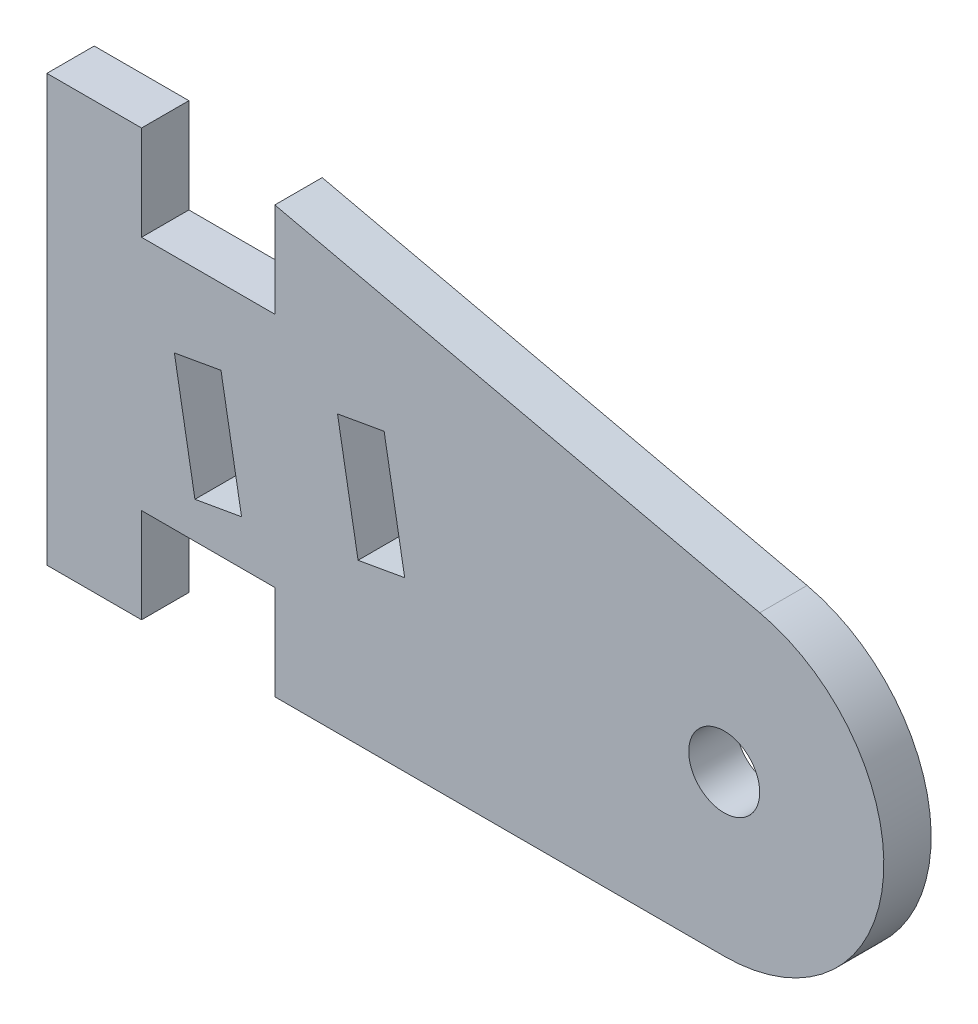
ISO-10303-21;
HEADER;
FILE_DESCRIPTION(('STEP AP214'),'2;1');
FILE_NAME('part.step','',(''),(''),'','','');
FILE_SCHEMA(('AUTOMOTIVE_DESIGN { 1 0 10303 214 1 1 1 1 }'));
ENDSEC;
DATA;
#1=APPLICATION_CONTEXT('core data for automotive mechanical design processes');
#2=APPLICATION_PROTOCOL_DEFINITION('international standard','automotive_design',2000,#1);
#3=PRODUCT_CONTEXT('',#1,'mechanical');
#4=PRODUCT('Part','Part','',(#3));
#5=PRODUCT_RELATED_PRODUCT_CATEGORY('part','',(#4));
#6=PRODUCT_DEFINITION_FORMATION('','',#4);
#7=PRODUCT_DEFINITION_CONTEXT('part definition',#1,'design');
#8=PRODUCT_DEFINITION('design','',#6,#7);
#9=PRODUCT_DEFINITION_SHAPE('','',#8);
#10=(LENGTH_UNIT() NAMED_UNIT(*) SI_UNIT(.MILLI.,.METRE.));
#11=(NAMED_UNIT(*) PLANE_ANGLE_UNIT() SI_UNIT($,.RADIAN.));
#12=(NAMED_UNIT(*) SI_UNIT($,.STERADIAN.) SOLID_ANGLE_UNIT());
#13=UNCERTAINTY_MEASURE_WITH_UNIT(LENGTH_MEASURE(1.E-05),#10,'distance_accuracy_value','');
#14=(GEOMETRIC_REPRESENTATION_CONTEXT(3) GLOBAL_UNCERTAINTY_ASSIGNED_CONTEXT((#13)) GLOBAL_UNIT_ASSIGNED_CONTEXT((#10,
#11,#12)) REPRESENTATION_CONTEXT('',''));
#15=CARTESIAN_POINT('',(0.,0.,0.));
#16=DIRECTION('',(0.,0.,1.));
#17=DIRECTION('',(1.,0.,0.));
#18=AXIS2_PLACEMENT_3D('',#15,#16,#17);
#19=CARTESIAN_POINT('',(28.6215163494173,6.74504414299814,2.));
#20=DIRECTION('',(0.,0.,1.));
#21=DIRECTION('',(1.,0.,0.));
#22=AXIS2_PLACEMENT_3D('',#19,#20,#21);
#23=PLANE('',#22);
#24=DIRECTION('',(-0.984807753012208,-0.173648177666932,0.));
#25=VECTOR('',#24,1.);
#26=CARTESIAN_POINT('',(14.2504500193325,12.02557168038,2.));
#27=LINE('',#26,#25);
#28=CARTESIAN_POINT('',(14.2504500193325,12.02557168038,2.));
#29=VERTEX_POINT('',#28);
#30=CARTESIAN_POINT('',(12.280834513308,11.6782753250461,2.));
#31=VERTEX_POINT('',#30);
#32=EDGE_CURVE('E177',#29,#31,#27,.T.);
#33=ORIENTED_EDGE('',*,*,#32,.F.);
#34=DIRECTION('',(-0.173648177666932,0.984807753012208,0.));
#35=VECTOR('',#34,1.);
#36=CARTESIAN_POINT('',(14.2504500193325,12.02557168038,2.));
#37=LINE('',#36,#35);
#38=CARTESIAN_POINT('',(15.1186909076671,7.10153291531894,2.));
#39=VERTEX_POINT('',#38);
#40=EDGE_CURVE('E169',#39,#29,#37,.T.);
#41=ORIENTED_EDGE('',*,*,#40,.F.);
#42=DIRECTION('',(0.984807753012208,0.173648177666931,0.));
#43=VECTOR('',#42,1.);
#44=CARTESIAN_POINT('',(13.1490754016427,6.75423655998508,2.));
#45=LINE('',#44,#43);
#46=CARTESIAN_POINT('',(13.1490754016427,6.75423655998508,2.));
#47=VERTEX_POINT('',#46);
#48=EDGE_CURVE('E192',#47,#39,#45,.T.);
#49=ORIENTED_EDGE('',*,*,#48,.F.);
#50=DIRECTION('',(0.173648177666932,-0.984807753012208,0.));
#51=VECTOR('',#50,1.);
#52=CARTESIAN_POINT('',(12.280834513308,11.6782753250461,2.));
#53=LINE('',#52,#51);
#54=EDGE_CURVE('E190',#31,#47,#53,.T.);
#55=ORIENTED_EDGE('',*,*,#54,.F.);
#56=EDGE_LOOP('',(#33,#41,#49,#55));
#57=FACE_BOUND('',#56,.T.);
#58=DIRECTION('',(0.,-1.,0.));
#59=VECTOR('',#58,1.);
#60=CARTESIAN_POINT('',(9.63151634941732,18.0003410835651,2.));
#61=LINE('',#60,#59);
#62=CARTESIAN_POINT('',(9.63151634941732,18.0003410835651,2.));
#63=VERTEX_POINT('',#62);
#64=CARTESIAN_POINT('',(9.63151634941733,14.0003410835651,2.));
#65=VERTEX_POINT('',#64);
#66=EDGE_CURVE('E239',#63,#65,#61,.T.);
#67=ORIENTED_EDGE('',*,*,#66,.T.);
#68=DIRECTION('',(-1.,0.,0.));
#69=VECTOR('',#68,1.);
#70=CARTESIAN_POINT('',(9.63151634941733,14.0003410835651,2.));
#71=LINE('',#70,#69);
#72=CARTESIAN_POINT('',(4.,14.0003410835651,2.));
#73=VERTEX_POINT('',#72);
#74=EDGE_CURVE('E242',#65,#73,#71,.T.);
#75=ORIENTED_EDGE('',*,*,#74,.T.);
#76=DIRECTION('',(0.,1.,0.));
#77=VECTOR('',#76,1.);
#78=CARTESIAN_POINT('',(4.,18.0003410835651,2.));
#79=LINE('',#78,#77);
#80=CARTESIAN_POINT('',(4.,18.0003410835651,2.));
#81=VERTEX_POINT('',#80);
#82=EDGE_CURVE('E245',#73,#81,#79,.T.);
#83=ORIENTED_EDGE('',*,*,#82,.T.);
#84=DIRECTION('',(-1.,0.,0.));
#85=VECTOR('',#84,1.);
#86=CARTESIAN_POINT('',(0.,18.0003410835651,2.));
#87=LINE('',#86,#85);
#88=CARTESIAN_POINT('',(0.,18.0003410835651,2.));
#89=VERTEX_POINT('',#88);
#90=EDGE_CURVE('E247',#81,#89,#87,.T.);
#91=ORIENTED_EDGE('',*,*,#90,.T.);
#92=DIRECTION('',(0.,-1.,0.));
#93=VECTOR('',#92,1.);
#94=CARTESIAN_POINT('',(0.,0.,2.));
#95=LINE('',#94,#93);
#96=CARTESIAN_POINT('',(0.,0.,2.));
#97=VERTEX_POINT('',#96);
#98=EDGE_CURVE('E249',#89,#97,#95,.T.);
#99=ORIENTED_EDGE('',*,*,#98,.T.);
#100=DIRECTION('',(1.,0.,0.));
#101=VECTOR('',#100,1.);
#102=CARTESIAN_POINT('',(0.,0.,2.));
#103=LINE('',#102,#101);
#104=CARTESIAN_POINT('',(4.,0.,2.));
#105=VERTEX_POINT('',#104);
#106=EDGE_CURVE('E251',#97,#105,#103,.T.);
#107=ORIENTED_EDGE('',*,*,#106,.T.);
#108=DIRECTION('',(0.,1.,0.));
#109=VECTOR('',#108,1.);
#110=CARTESIAN_POINT('',(4.,0.,2.));
#111=LINE('',#110,#109);
#112=CARTESIAN_POINT('',(4.,4.,2.));
#113=VERTEX_POINT('',#112);
#114=EDGE_CURVE('E253',#105,#113,#111,.T.);
#115=ORIENTED_EDGE('',*,*,#114,.T.);
#116=DIRECTION('',(1.,0.,0.));
#117=VECTOR('',#116,1.);
#118=CARTESIAN_POINT('',(9.63151634941733,4.,2.));
#119=LINE('',#118,#117);
#120=CARTESIAN_POINT('',(9.63151634941733,4.,2.));
#121=VERTEX_POINT('',#120);
#122=EDGE_CURVE('E255',#113,#121,#119,.T.);
#123=ORIENTED_EDGE('',*,*,#122,.T.);
#124=DIRECTION('',(0.,-1.,0.));
#125=VECTOR('',#124,1.);
#126=CARTESIAN_POINT('',(9.63151634941733,0.,2.));
#127=LINE('',#126,#125);
#128=CARTESIAN_POINT('',(9.63151634941733,0.,2.));
#129=VERTEX_POINT('',#128);
#130=EDGE_CURVE('E257',#121,#129,#127,.T.);
#131=ORIENTED_EDGE('',*,*,#130,.T.);
#132=DIRECTION('',(1.,0.,0.));
#133=VECTOR('',#132,1.);
#134=CARTESIAN_POINT('',(9.63151634941733,0.,2.));
#135=LINE('',#134,#133);
#136=CARTESIAN_POINT('',(28.6215163494173,0.,2.));
#137=VERTEX_POINT('',#136);
#138=EDGE_CURVE('E259',#129,#137,#135,.T.);
#139=ORIENTED_EDGE('',*,*,#138,.T.);
#140=CARTESIAN_POINT('',(28.6215163494173,6.74504414299814,2.));
#141=DIRECTION('',(0.,0.,1.));
#142=DIRECTION('',(1.,0.,0.));
#143=AXIS2_PLACEMENT_3D('',#140,#141,#142);
#144=CIRCLE('',#143,6.74504414299814);
#145=CARTESIAN_POINT('',(30.1231764912827,13.3208054912624,2.));
#146=VERTEX_POINT('',#145);
#147=EDGE_CURVE('E261',#137,#146,#144,.T.);
#148=ORIENTED_EDGE('',*,*,#147,.T.);
#149=DIRECTION('',(-0.974902640939778,0.222631625535649,0.));
#150=VECTOR('',#149,1.);
#151=CARTESIAN_POINT('',(9.63151634941732,18.0003410835651,2.));
#152=LINE('',#151,#150);
#153=EDGE_CURVE('E263',#146,#63,#152,.T.);
#154=ORIENTED_EDGE('',*,*,#153,.T.);
#155=EDGE_LOOP('',(#67,#75,#83,#91,#99,#107,#115,#123,#131,#139,#148,#154));
#156=FACE_BOUND('',#155,.T.);
#157=DIRECTION('',(0.173648177666931,-0.984807753012208,0.));
#158=VECTOR('',#157,1.);
#159=CARTESIAN_POINT('',(5.38718024222247,10.4627380813776,2.));
#160=LINE('',#159,#158);
#161=CARTESIAN_POINT('',(5.38718024222247,10.4627380813776,2.));
#162=VERTEX_POINT('',#161);
#163=CARTESIAN_POINT('',(6.25542113055713,5.53869931631654,2.));
#164=VERTEX_POINT('',#163);
#165=EDGE_CURVE('E210',#162,#164,#160,.T.);
#166=ORIENTED_EDGE('',*,*,#165,.F.);
#167=DIRECTION('',(-0.984807753012208,-0.173648177666931,0.));
#168=VECTOR('',#167,1.);
#169=CARTESIAN_POINT('',(7.35679574824689,10.8100344367115,2.));
#170=LINE('',#169,#168);
#171=CARTESIAN_POINT('',(7.35679574824689,10.8100344367115,2.));
#172=VERTEX_POINT('',#171);
#173=EDGE_CURVE('E208',#172,#162,#170,.T.);
#174=ORIENTED_EDGE('',*,*,#173,.F.);
#175=DIRECTION('',(-0.173648177666931,0.984807753012208,0.));
#176=VECTOR('',#175,1.);
#177=CARTESIAN_POINT('',(7.35679574824689,10.8100344367115,2.));
#178=LINE('',#177,#176);
#179=CARTESIAN_POINT('',(8.22503663658155,5.88599567165041,2.));
#180=VERTEX_POINT('',#179);
#181=EDGE_CURVE('E216',#180,#172,#178,.T.);
#182=ORIENTED_EDGE('',*,*,#181,.F.);
#183=DIRECTION('',(0.984807753012208,0.173648177666932,0.));
#184=VECTOR('',#183,1.);
#185=CARTESIAN_POINT('',(6.25542113055713,5.53869931631654,2.));
#186=LINE('',#185,#184);
#187=EDGE_CURVE('E213',#164,#180,#186,.T.);
#188=ORIENTED_EDGE('',*,*,#187,.F.);
#189=EDGE_LOOP('',(#166,#174,#182,#188));
#190=FACE_BOUND('',#189,.T.);
#191=CARTESIAN_POINT('',(28.6215163494173,6.74504414299814,2.));
#192=DIRECTION('',(0.,0.,1.));
#193=DIRECTION('',(1.,0.,0.));
#194=AXIS2_PLACEMENT_3D('',#191,#192,#193);
#195=CIRCLE('',#194,1.49999999999871);
#196=CARTESIAN_POINT('',(30.121516349416,6.74504414299814,2.));
#197=VERTEX_POINT('',#196);
#198=EDGE_CURVE('E198',#197,#197,#195,.T.);
#199=ORIENTED_EDGE('',*,*,#198,.F.);
#200=EDGE_LOOP('',(#199));
#201=FACE_BOUND('',#200,.T.);
#202=ADVANCED_FACE('F32',(#57,#156,#190,#201),#23,.T.);
#203=CARTESIAN_POINT('',(28.6215163494173,6.74504414299814,0.));
#204=DIRECTION('',(0.,0.,1.));
#205=DIRECTION('',(1.,0.,0.));
#206=AXIS2_PLACEMENT_3D('',#203,#204,#205);
#207=PLANE('',#206);
#208=DIRECTION('',(-0.173648177666932,0.984807753012208,0.));
#209=VECTOR('',#208,1.);
#210=CARTESIAN_POINT('',(14.2504500193325,12.02557168038,0.));
#211=LINE('',#210,#209);
#212=CARTESIAN_POINT('',(15.1186909076671,7.10153291531894,0.));
#213=VERTEX_POINT('',#212);
#214=CARTESIAN_POINT('',(14.2504500193325,12.02557168038,0.));
#215=VERTEX_POINT('',#214);
#216=EDGE_CURVE('E55',#213,#215,#211,.T.);
#217=ORIENTED_EDGE('',*,*,#216,.T.);
#218=DIRECTION('',(-0.984807753012208,-0.173648177666932,0.));
#219=VECTOR('',#218,1.);
#220=CARTESIAN_POINT('',(14.2504500193325,12.02557168038,0.));
#221=LINE('',#220,#219);
#222=CARTESIAN_POINT('',(12.280834513308,11.6782753250461,0.));
#223=VERTEX_POINT('',#222);
#224=EDGE_CURVE('E184',#215,#223,#221,.T.);
#225=ORIENTED_EDGE('',*,*,#224,.T.);
#226=DIRECTION('',(0.173648177666932,-0.984807753012208,0.));
#227=VECTOR('',#226,1.);
#228=CARTESIAN_POINT('',(12.280834513308,11.6782753250461,0.));
#229=LINE('',#228,#227);
#230=CARTESIAN_POINT('',(13.1490754016427,6.75423655998508,0.));
#231=VERTEX_POINT('',#230);
#232=EDGE_CURVE('E200',#223,#231,#229,.T.);
#233=ORIENTED_EDGE('',*,*,#232,.T.);
#234=DIRECTION('',(0.984807753012208,0.173648177666931,0.));
#235=VECTOR('',#234,1.);
#236=CARTESIAN_POINT('',(13.1490754016427,6.75423655998508,0.));
#237=LINE('',#236,#235);
#238=EDGE_CURVE('E178',#231,#213,#237,.T.);
#239=ORIENTED_EDGE('',*,*,#238,.T.);
#240=EDGE_LOOP('',(#217,#225,#233,#239));
#241=FACE_BOUND('',#240,.T.);
#242=DIRECTION('',(0.,-1.,0.));
#243=VECTOR('',#242,1.);
#244=CARTESIAN_POINT('',(9.63151634941732,18.0003410835651,0.));
#245=LINE('',#244,#243);
#246=CARTESIAN_POINT('',(9.63151634941732,18.0003410835651,0.));
#247=VERTEX_POINT('',#246);
#248=CARTESIAN_POINT('',(9.63151634941733,14.0003410835651,0.));
#249=VERTEX_POINT('',#248);
#250=EDGE_CURVE('E238',#247,#249,#245,.T.);
#251=ORIENTED_EDGE('',*,*,#250,.F.);
#252=DIRECTION('',(-0.974902640939778,0.222631625535649,0.));
#253=VECTOR('',#252,1.);
#254=CARTESIAN_POINT('',(9.63151634941732,18.0003410835651,0.));
#255=LINE('',#254,#253);
#256=CARTESIAN_POINT('',(30.1231764912827,13.3208054912624,0.));
#257=VERTEX_POINT('',#256);
#258=EDGE_CURVE('E243',#257,#247,#255,.T.);
#259=ORIENTED_EDGE('',*,*,#258,.F.);
#260=CARTESIAN_POINT('',(28.6215163494173,6.74504414299814,0.));
#261=DIRECTION('',(0.,0.,1.));
#262=DIRECTION('',(1.,0.,0.));
#263=AXIS2_PLACEMENT_3D('',#260,#261,#262);
#264=CIRCLE('',#263,6.74504414299814);
#265=CARTESIAN_POINT('',(28.6215163494173,0.,0.));
#266=VERTEX_POINT('',#265);
#267=EDGE_CURVE('E286',#266,#257,#264,.T.);
#268=ORIENTED_EDGE('',*,*,#267,.F.);
#269=DIRECTION('',(1.,0.,0.));
#270=VECTOR('',#269,1.);
#271=CARTESIAN_POINT('',(9.63151634941733,0.,0.));
#272=LINE('',#271,#270);
#273=CARTESIAN_POINT('',(9.63151634941733,0.,0.));
#274=VERTEX_POINT('',#273);
#275=EDGE_CURVE('E284',#274,#266,#272,.T.);
#276=ORIENTED_EDGE('',*,*,#275,.F.);
#277=DIRECTION('',(0.,-1.,0.));
#278=VECTOR('',#277,1.);
#279=CARTESIAN_POINT('',(9.63151634941733,0.,0.));
#280=LINE('',#279,#278);
#281=CARTESIAN_POINT('',(9.63151634941733,4.,0.));
#282=VERTEX_POINT('',#281);
#283=EDGE_CURVE('E282',#282,#274,#280,.T.);
#284=ORIENTED_EDGE('',*,*,#283,.F.);
#285=DIRECTION('',(1.,0.,0.));
#286=VECTOR('',#285,1.);
#287=CARTESIAN_POINT('',(9.63151634941733,4.,0.));
#288=LINE('',#287,#286);
#289=CARTESIAN_POINT('',(4.,4.,0.));
#290=VERTEX_POINT('',#289);
#291=EDGE_CURVE('E280',#290,#282,#288,.T.);
#292=ORIENTED_EDGE('',*,*,#291,.F.);
#293=DIRECTION('',(0.,1.,0.));
#294=VECTOR('',#293,1.);
#295=CARTESIAN_POINT('',(4.,0.,0.));
#296=LINE('',#295,#294);
#297=CARTESIAN_POINT('',(4.,0.,0.));
#298=VERTEX_POINT('',#297);
#299=EDGE_CURVE('E278',#298,#290,#296,.T.);
#300=ORIENTED_EDGE('',*,*,#299,.F.);
#301=DIRECTION('',(1.,0.,0.));
#302=VECTOR('',#301,1.);
#303=CARTESIAN_POINT('',(0.,0.,0.));
#304=LINE('',#303,#302);
#305=CARTESIAN_POINT('',(0.,0.,0.));
#306=VERTEX_POINT('',#305);
#307=EDGE_CURVE('E276',#306,#298,#304,.T.);
#308=ORIENTED_EDGE('',*,*,#307,.F.);
#309=DIRECTION('',(0.,-1.,0.));
#310=VECTOR('',#309,1.);
#311=CARTESIAN_POINT('',(0.,0.,0.));
#312=LINE('',#311,#310);
#313=CARTESIAN_POINT('',(0.,18.0003410835651,0.));
#314=VERTEX_POINT('',#313);
#315=EDGE_CURVE('E274',#314,#306,#312,.T.);
#316=ORIENTED_EDGE('',*,*,#315,.F.);
#317=DIRECTION('',(-1.,0.,0.));
#318=VECTOR('',#317,1.);
#319=CARTESIAN_POINT('',(0.,18.0003410835651,0.));
#320=LINE('',#319,#318);
#321=CARTESIAN_POINT('',(4.,18.0003410835651,0.));
#322=VERTEX_POINT('',#321);
#323=EDGE_CURVE('E272',#322,#314,#320,.T.);
#324=ORIENTED_EDGE('',*,*,#323,.F.);
#325=DIRECTION('',(0.,1.,0.));
#326=VECTOR('',#325,1.);
#327=CARTESIAN_POINT('',(4.,18.0003410835651,0.));
#328=LINE('',#327,#326);
#329=CARTESIAN_POINT('',(4.,14.0003410835651,0.));
#330=VERTEX_POINT('',#329);
#331=EDGE_CURVE('E270',#330,#322,#328,.T.);
#332=ORIENTED_EDGE('',*,*,#331,.F.);
#333=DIRECTION('',(-1.,0.,0.));
#334=VECTOR('',#333,1.);
#335=CARTESIAN_POINT('',(9.63151634941733,14.0003410835651,0.));
#336=LINE('',#335,#334);
#337=EDGE_CURVE('E268',#249,#330,#336,.T.);
#338=ORIENTED_EDGE('',*,*,#337,.F.);
#339=EDGE_LOOP('',(#251,#259,#268,#276,#284,#292,#300,#308,#316,#324,#332,#338));
#340=FACE_BOUND('',#339,.T.);
#341=DIRECTION('',(-0.984807753012208,-0.173648177666931,0.));
#342=VECTOR('',#341,1.);
#343=CARTESIAN_POINT('',(7.35679574824689,10.8100344367115,0.));
#344=LINE('',#343,#342);
#345=CARTESIAN_POINT('',(7.35679574824689,10.8100344367115,0.));
#346=VERTEX_POINT('',#345);
#347=CARTESIAN_POINT('',(5.38718024222247,10.4627380813776,0.));
#348=VERTEX_POINT('',#347);
#349=EDGE_CURVE('E185',#346,#348,#344,.T.);
#350=ORIENTED_EDGE('',*,*,#349,.T.);
#351=DIRECTION('',(0.173648177666931,-0.984807753012208,0.));
#352=VECTOR('',#351,1.);
#353=CARTESIAN_POINT('',(5.38718024222247,10.4627380813776,0.));
#354=LINE('',#353,#352);
#355=CARTESIAN_POINT('',(6.25542113055713,5.53869931631654,0.));
#356=VERTEX_POINT('',#355);
#357=EDGE_CURVE('E221',#348,#356,#354,.T.);
#358=ORIENTED_EDGE('',*,*,#357,.T.);
#359=DIRECTION('',(0.984807753012208,0.173648177666932,0.));
#360=VECTOR('',#359,1.);
#361=CARTESIAN_POINT('',(6.25542113055713,5.53869931631654,0.));
#362=LINE('',#361,#360);
#363=CARTESIAN_POINT('',(8.22503663658155,5.88599567165041,0.));
#364=VERTEX_POINT('',#363);
#365=EDGE_CURVE('E224',#356,#364,#362,.T.);
#366=ORIENTED_EDGE('',*,*,#365,.T.);
#367=DIRECTION('',(-0.173648177666931,0.984807753012208,0.));
#368=VECTOR('',#367,1.);
#369=CARTESIAN_POINT('',(7.35679574824689,10.8100344367115,0.));
#370=LINE('',#369,#368);
#371=EDGE_CURVE('E211',#364,#346,#370,.T.);
#372=ORIENTED_EDGE('',*,*,#371,.T.);
#373=EDGE_LOOP('',(#350,#358,#366,#372));
#374=FACE_BOUND('',#373,.T.);
#375=CARTESIAN_POINT('',(28.6215163494173,6.74504414299814,0.));
#376=DIRECTION('',(0.,0.,1.));
#377=DIRECTION('',(1.,0.,0.));
#378=AXIS2_PLACEMENT_3D('',#375,#376,#377);
#379=CIRCLE('',#378,1.49999999999871);
#380=CARTESIAN_POINT('',(30.121516349416,6.74504414299814,0.));
#381=VERTEX_POINT('',#380);
#382=EDGE_CURVE('E580',#381,#381,#379,.T.);
#383=ORIENTED_EDGE('',*,*,#382,.T.);
#384=EDGE_LOOP('',(#383));
#385=FACE_BOUND('',#384,.T.);
#386=ADVANCED_FACE('F328',(#241,#340,#374,#385),#207,.F.);
#387=CARTESIAN_POINT('',(9.63151634941732,18.0003410835651,2.));
#388=DIRECTION('',(1.,0.,0.));
#389=DIRECTION('',(0.,1.,0.));
#390=AXIS2_PLACEMENT_3D('',#387,#388,#389);
#391=PLANE('',#390);
#392=ORIENTED_EDGE('',*,*,#250,.T.);
#393=DIRECTION('',(0.,0.,-1.));
#394=VECTOR('',#393,1.);
#395=CARTESIAN_POINT('',(9.63151634941733,14.0003410835651,2.));
#396=LINE('',#395,#394);
#397=EDGE_CURVE('E11',#65,#249,#396,.T.);
#398=ORIENTED_EDGE('',*,*,#397,.F.);
#399=ORIENTED_EDGE('',*,*,#66,.F.);
#400=DIRECTION('',(0.,0.,-1.));
#401=VECTOR('',#400,1.);
#402=CARTESIAN_POINT('',(9.63151634941732,18.0003410835651,2.));
#403=LINE('',#402,#401);
#404=EDGE_CURVE('E265',#63,#247,#403,.T.);
#405=ORIENTED_EDGE('',*,*,#404,.T.);
#406=EDGE_LOOP('',(#392,#398,#399,#405));
#407=FACE_BOUND('',#406,.T.);
#408=ADVANCED_FACE('F34',(#407),#391,.F.);
#409=CARTESIAN_POINT('',(9.63151634941733,14.0003410835651,2.));
#410=DIRECTION('',(0.,-1.,0.));
#411=DIRECTION('',(1.,0.,0.));
#412=AXIS2_PLACEMENT_3D('',#409,#410,#411);
#413=PLANE('',#412);
#414=ORIENTED_EDGE('',*,*,#337,.T.);
#415=DIRECTION('',(0.,0.,-1.));
#416=VECTOR('',#415,1.);
#417=CARTESIAN_POINT('',(4.,14.0003410835651,2.));
#418=LINE('',#417,#416);
#419=EDGE_CURVE('E40',#73,#330,#418,.T.);
#420=ORIENTED_EDGE('',*,*,#419,.F.);
#421=ORIENTED_EDGE('',*,*,#74,.F.);
#422=ORIENTED_EDGE('',*,*,#397,.T.);
#423=EDGE_LOOP('',(#414,#420,#421,#422));
#424=FACE_BOUND('',#423,.T.);
#425=ADVANCED_FACE('F345',(#424),#413,.F.);
#426=CARTESIAN_POINT('',(4.,18.0003410835651,2.));
#427=DIRECTION('',(-1.,0.,0.));
#428=DIRECTION('',(0.,-1.,0.));
#429=AXIS2_PLACEMENT_3D('',#426,#427,#428);
#430=PLANE('',#429);
#431=ORIENTED_EDGE('',*,*,#331,.T.);
#432=DIRECTION('',(0.,0.,-1.));
#433=VECTOR('',#432,1.);
#434=CARTESIAN_POINT('',(4.,18.0003410835651,2.));
#435=LINE('',#434,#433);
#436=EDGE_CURVE('E315',#81,#322,#435,.T.);
#437=ORIENTED_EDGE('',*,*,#436,.F.);
#438=ORIENTED_EDGE('',*,*,#82,.F.);
#439=ORIENTED_EDGE('',*,*,#419,.T.);
#440=EDGE_LOOP('',(#431,#437,#438,#439));
#441=FACE_BOUND('',#440,.T.);
#442=ADVANCED_FACE('F322',(#441),#430,.F.);
#443=CARTESIAN_POINT('',(0.,18.0003410835651,2.));
#444=DIRECTION('',(0.,-1.,0.));
#445=DIRECTION('',(0.,0.,-1.));
#446=AXIS2_PLACEMENT_3D('',#443,#444,#445);
#447=PLANE('',#446);
#448=ORIENTED_EDGE('',*,*,#323,.T.);
#449=DIRECTION('',(0.,0.,-1.));
#450=VECTOR('',#449,1.);
#451=CARTESIAN_POINT('',(0.,18.0003410835651,2.));
#452=LINE('',#451,#450);
#453=EDGE_CURVE('E312',#89,#314,#452,.T.);
#454=ORIENTED_EDGE('',*,*,#453,.F.);
#455=ORIENTED_EDGE('',*,*,#90,.F.);
#456=ORIENTED_EDGE('',*,*,#436,.T.);
#457=EDGE_LOOP('',(#448,#454,#455,#456));
#458=FACE_BOUND('',#457,.T.);
#459=ADVANCED_FACE('F334',(#458),#447,.F.);
#460=CARTESIAN_POINT('',(0.,0.,2.));
#461=DIRECTION('',(1.,0.,0.));
#462=DIRECTION('',(0.,1.,0.));
#463=AXIS2_PLACEMENT_3D('',#460,#461,#462);
#464=PLANE('',#463);
#465=ORIENTED_EDGE('',*,*,#315,.T.);
#466=DIRECTION('',(0.,0.,-1.));
#467=VECTOR('',#466,1.);
#468=CARTESIAN_POINT('',(0.,0.,2.));
#469=LINE('',#468,#467);
#470=EDGE_CURVE('E309',#97,#306,#469,.T.);
#471=ORIENTED_EDGE('',*,*,#470,.F.);
#472=ORIENTED_EDGE('',*,*,#98,.F.);
#473=ORIENTED_EDGE('',*,*,#453,.T.);
#474=EDGE_LOOP('',(#465,#471,#472,#473));
#475=FACE_BOUND('',#474,.T.);
#476=ADVANCED_FACE('F338',(#475),#464,.F.);
#477=CARTESIAN_POINT('',(0.,0.,2.));
#478=DIRECTION('',(0.,1.,0.));
#479=DIRECTION('',(0.,0.,1.));
#480=AXIS2_PLACEMENT_3D('',#477,#478,#479);
#481=PLANE('',#480);
#482=ORIENTED_EDGE('',*,*,#307,.T.);
#483=DIRECTION('',(0.,0.,-1.));
#484=VECTOR('',#483,1.);
#485=CARTESIAN_POINT('',(4.,0.,2.));
#486=LINE('',#485,#484);
#487=EDGE_CURVE('E306',#105,#298,#486,.T.);
#488=ORIENTED_EDGE('',*,*,#487,.F.);
#489=ORIENTED_EDGE('',*,*,#106,.F.);
#490=ORIENTED_EDGE('',*,*,#470,.T.);
#491=EDGE_LOOP('',(#482,#488,#489,#490));
#492=FACE_BOUND('',#491,.T.);
#493=ADVANCED_FACE('F378',(#492),#481,.F.);
#494=CARTESIAN_POINT('',(4.,0.,2.));
#495=DIRECTION('',(-1.,0.,0.));
#496=DIRECTION('',(0.,0.,1.));
#497=AXIS2_PLACEMENT_3D('',#494,#495,#496);
#498=PLANE('',#497);
#499=ORIENTED_EDGE('',*,*,#299,.T.);
#500=DIRECTION('',(0.,0.,-1.));
#501=VECTOR('',#500,1.);
#502=CARTESIAN_POINT('',(4.,4.,2.));
#503=LINE('',#502,#501);
#504=EDGE_CURVE('E303',#113,#290,#503,.T.);
#505=ORIENTED_EDGE('',*,*,#504,.F.);
#506=ORIENTED_EDGE('',*,*,#114,.F.);
#507=ORIENTED_EDGE('',*,*,#487,.T.);
#508=EDGE_LOOP('',(#499,#505,#506,#507));
#509=FACE_BOUND('',#508,.T.);
#510=ADVANCED_FACE('F376',(#509),#498,.F.);
#511=CARTESIAN_POINT('',(9.63151634941733,4.,2.));
#512=DIRECTION('',(0.,1.,0.));
#513=DIRECTION('',(-1.,0.,0.));
#514=AXIS2_PLACEMENT_3D('',#511,#512,#513);
#515=PLANE('',#514);
#516=ORIENTED_EDGE('',*,*,#291,.T.);
#517=DIRECTION('',(0.,0.,-1.));
#518=VECTOR('',#517,1.);
#519=CARTESIAN_POINT('',(9.63151634941733,4.,2.));
#520=LINE('',#519,#518);
#521=EDGE_CURVE('E300',#121,#282,#520,.T.);
#522=ORIENTED_EDGE('',*,*,#521,.F.);
#523=ORIENTED_EDGE('',*,*,#122,.F.);
#524=ORIENTED_EDGE('',*,*,#504,.T.);
#525=EDGE_LOOP('',(#516,#522,#523,#524));
#526=FACE_BOUND('',#525,.T.);
#527=ADVANCED_FACE('F372',(#526),#515,.F.);
#528=CARTESIAN_POINT('',(9.63151634941733,0.,2.));
#529=DIRECTION('',(1.,0.,0.));
#530=DIRECTION('',(0.,0.,-1.));
#531=AXIS2_PLACEMENT_3D('',#528,#529,#530);
#532=PLANE('',#531);
#533=ORIENTED_EDGE('',*,*,#283,.T.);
#534=DIRECTION('',(0.,0.,-1.));
#535=VECTOR('',#534,1.);
#536=CARTESIAN_POINT('',(9.63151634941733,0.,2.));
#537=LINE('',#536,#535);
#538=EDGE_CURVE('E297',#129,#274,#537,.T.);
#539=ORIENTED_EDGE('',*,*,#538,.F.);
#540=ORIENTED_EDGE('',*,*,#130,.F.);
#541=ORIENTED_EDGE('',*,*,#521,.T.);
#542=EDGE_LOOP('',(#533,#539,#540,#541));
#543=FACE_BOUND('',#542,.T.);
#544=ADVANCED_FACE('F367',(#543),#532,.F.);
#545=CARTESIAN_POINT('',(9.63151634941733,0.,2.));
#546=DIRECTION('',(0.,1.,0.));
#547=DIRECTION('',(0.,0.,1.));
#548=AXIS2_PLACEMENT_3D('',#545,#546,#547);
#549=PLANE('',#548);
#550=ORIENTED_EDGE('',*,*,#275,.T.);
#551=DIRECTION('',(0.,0.,-1.));
#552=VECTOR('',#551,1.);
#553=CARTESIAN_POINT('',(28.6215163494173,0.,2.));
#554=LINE('',#553,#552);
#555=EDGE_CURVE('E294',#137,#266,#554,.T.);
#556=ORIENTED_EDGE('',*,*,#555,.F.);
#557=ORIENTED_EDGE('',*,*,#138,.F.);
#558=ORIENTED_EDGE('',*,*,#538,.T.);
#559=EDGE_LOOP('',(#550,#556,#557,#558));
#560=FACE_BOUND('',#559,.T.);
#561=ADVANCED_FACE('F361',(#560),#549,.F.);
#562=CARTESIAN_POINT('',(28.6215163494173,6.74504414299814,2.));
#563=DIRECTION('',(0.,0.,-1.));
#564=DIRECTION('',(-1.,0.,0.));
#565=AXIS2_PLACEMENT_3D('',#562,#563,#564);
#566=CYLINDRICAL_SURFACE('',#565,6.74504414299814);
#567=ORIENTED_EDGE('',*,*,#267,.T.);
#568=DIRECTION('',(0.,0.,-1.));
#569=VECTOR('',#568,1.);
#570=CARTESIAN_POINT('',(30.1231764912827,13.3208054912624,2.));
#571=LINE('',#570,#569);
#572=EDGE_CURVE('E291',#146,#257,#571,.T.);
#573=ORIENTED_EDGE('',*,*,#572,.F.);
#574=ORIENTED_EDGE('',*,*,#147,.F.);
#575=ORIENTED_EDGE('',*,*,#555,.T.);
#576=EDGE_LOOP('',(#567,#573,#574,#575));
#577=FACE_BOUND('',#576,.T.);
#578=ADVANCED_FACE('F357',(#577),#566,.T.);
#579=CARTESIAN_POINT('',(9.63151634941732,18.0003410835651,2.));
#580=DIRECTION('',(-0.222631625535649,-0.974902640939778,0.));
#581=DIRECTION('',(0.974902640939779,-0.222631625535649,0.));
#582=AXIS2_PLACEMENT_3D('',#579,#580,#581);
#583=PLANE('',#582);
#584=ORIENTED_EDGE('',*,*,#258,.T.);
#585=ORIENTED_EDGE('',*,*,#404,.F.);
#586=ORIENTED_EDGE('',*,*,#153,.F.);
#587=ORIENTED_EDGE('',*,*,#572,.T.);
#588=EDGE_LOOP('',(#584,#585,#586,#587));
#589=FACE_BOUND('',#588,.T.);
#590=ADVANCED_FACE('F352',(#589),#583,.F.);
#591=CARTESIAN_POINT('',(7.35679574824689,10.8100344367115,2.));
#592=DIRECTION('',(0.173648177666931,-0.984807753012208,0.));
#593=DIRECTION('',(0.984807753012208,0.173648177666931,0.));
#594=AXIS2_PLACEMENT_3D('',#591,#592,#593);
#595=PLANE('',#594);
#596=ORIENTED_EDGE('',*,*,#349,.F.);
#597=DIRECTION('',(0.,0.,-1.));
#598=VECTOR('',#597,1.);
#599=CARTESIAN_POINT('',(7.35679574824689,10.8100344367115,2.));
#600=LINE('',#599,#598);
#601=EDGE_CURVE('E218',#172,#346,#600,.T.);
#602=ORIENTED_EDGE('',*,*,#601,.F.);
#603=ORIENTED_EDGE('',*,*,#173,.T.);
#604=DIRECTION('',(0.,0.,-1.));
#605=VECTOR('',#604,1.);
#606=CARTESIAN_POINT('',(5.38718024222247,10.4627380813776,2.));
#607=LINE('',#606,#605);
#608=EDGE_CURVE('E235',#162,#348,#607,.T.);
#609=ORIENTED_EDGE('',*,*,#608,.T.);
#610=EDGE_LOOP('',(#596,#602,#603,#609));
#611=FACE_BOUND('',#610,.T.);
#612=ADVANCED_FACE('F395',(#611),#595,.T.);
#613=CARTESIAN_POINT('',(5.38718024222247,10.4627380813776,2.));
#614=DIRECTION('',(0.984807753012208,0.173648177666931,0.));
#615=DIRECTION('',(-0.173648177666931,0.984807753012208,0.));
#616=AXIS2_PLACEMENT_3D('',#613,#614,#615);
#617=PLANE('',#616);
#618=ORIENTED_EDGE('',*,*,#357,.F.);
#619=ORIENTED_EDGE('',*,*,#608,.F.);
#620=ORIENTED_EDGE('',*,*,#165,.T.);
#621=DIRECTION('',(0.,0.,-1.));
#622=VECTOR('',#621,1.);
#623=CARTESIAN_POINT('',(6.25542113055713,5.53869931631654,2.));
#624=LINE('',#623,#622);
#625=EDGE_CURVE('E233',#164,#356,#624,.T.);
#626=ORIENTED_EDGE('',*,*,#625,.T.);
#627=EDGE_LOOP('',(#618,#619,#620,#626));
#628=FACE_BOUND('',#627,.T.);
#629=ADVANCED_FACE('F433',(#628),#617,.T.);
#630=CARTESIAN_POINT('',(6.25542113055713,5.53869931631654,2.));
#631=DIRECTION('',(-0.173648177666932,0.984807753012208,0.));
#632=DIRECTION('',(-0.984807753012208,-0.173648177666932,0.));
#633=AXIS2_PLACEMENT_3D('',#630,#631,#632);
#634=PLANE('',#633);
#635=ORIENTED_EDGE('',*,*,#365,.F.);
#636=ORIENTED_EDGE('',*,*,#625,.F.);
#637=ORIENTED_EDGE('',*,*,#187,.T.);
#638=DIRECTION('',(0.,0.,-1.));
#639=VECTOR('',#638,1.);
#640=CARTESIAN_POINT('',(8.22503663658155,5.88599567165041,2.));
#641=LINE('',#640,#639);
#642=EDGE_CURVE('E231',#180,#364,#641,.T.);
#643=ORIENTED_EDGE('',*,*,#642,.T.);
#644=EDGE_LOOP('',(#635,#636,#637,#643));
#645=FACE_BOUND('',#644,.T.);
#646=ADVANCED_FACE('F440',(#645),#634,.T.);
#647=CARTESIAN_POINT('',(7.35679574824689,10.8100344367115,2.));
#648=DIRECTION('',(-0.984807753012208,-0.173648177666931,0.));
#649=DIRECTION('',(0.173648177666931,-0.984807753012208,0.));
#650=AXIS2_PLACEMENT_3D('',#647,#648,#649);
#651=PLANE('',#650);
#652=ORIENTED_EDGE('',*,*,#371,.F.);
#653=ORIENTED_EDGE('',*,*,#642,.F.);
#654=ORIENTED_EDGE('',*,*,#181,.T.);
#655=ORIENTED_EDGE('',*,*,#601,.T.);
#656=EDGE_LOOP('',(#652,#653,#654,#655));
#657=FACE_BOUND('',#656,.T.);
#658=ADVANCED_FACE('F447',(#657),#651,.T.);
#659=CARTESIAN_POINT('',(14.2504500193325,12.02557168038,2.));
#660=DIRECTION('',(-0.984807753012208,-0.173648177666932,0.));
#661=DIRECTION('',(0.173648177666932,-0.984807753012208,0.));
#662=AXIS2_PLACEMENT_3D('',#659,#660,#661);
#663=PLANE('',#662);
#664=ORIENTED_EDGE('',*,*,#216,.F.);
#665=DIRECTION('',(0.,0.,-1.));
#666=VECTOR('',#665,1.);
#667=CARTESIAN_POINT('',(15.1186909076671,7.10153291531894,2.));
#668=LINE('',#667,#666);
#669=EDGE_CURVE('E173',#39,#213,#668,.T.);
#670=ORIENTED_EDGE('',*,*,#669,.F.);
#671=ORIENTED_EDGE('',*,*,#40,.T.);
#672=DIRECTION('',(0.,0.,-1.));
#673=VECTOR('',#672,1.);
#674=CARTESIAN_POINT('',(14.2504500193325,12.02557168038,2.));
#675=LINE('',#674,#673);
#676=EDGE_CURVE('E172',#29,#215,#675,.T.);
#677=ORIENTED_EDGE('',*,*,#676,.T.);
#678=EDGE_LOOP('',(#664,#670,#671,#677));
#679=FACE_BOUND('',#678,.T.);
#680=ADVANCED_FACE('F171',(#679),#663,.T.);
#681=CARTESIAN_POINT('',(14.2504500193325,12.02557168038,2.));
#682=DIRECTION('',(0.173648177666932,-0.984807753012208,0.));
#683=DIRECTION('',(0.984807753012208,0.173648177666932,0.));
#684=AXIS2_PLACEMENT_3D('',#681,#682,#683);
#685=PLANE('',#684);
#686=ORIENTED_EDGE('',*,*,#224,.F.);
#687=ORIENTED_EDGE('',*,*,#676,.F.);
#688=ORIENTED_EDGE('',*,*,#32,.T.);
#689=DIRECTION('',(0.,0.,-1.));
#690=VECTOR('',#689,1.);
#691=CARTESIAN_POINT('',(12.280834513308,11.6782753250461,2.));
#692=LINE('',#691,#690);
#693=EDGE_CURVE('E186',#31,#223,#692,.T.);
#694=ORIENTED_EDGE('',*,*,#693,.T.);
#695=EDGE_LOOP('',(#686,#687,#688,#694));
#696=FACE_BOUND('',#695,.T.);
#697=ADVANCED_FACE('F181',(#696),#685,.T.);
#698=CARTESIAN_POINT('',(12.280834513308,11.6782753250461,2.));
#699=DIRECTION('',(0.984807753012208,0.173648177666932,0.));
#700=DIRECTION('',(-0.173648177666932,0.984807753012208,0.));
#701=AXIS2_PLACEMENT_3D('',#698,#699,#700);
#702=PLANE('',#701);
#703=ORIENTED_EDGE('',*,*,#232,.F.);
#704=ORIENTED_EDGE('',*,*,#693,.F.);
#705=ORIENTED_EDGE('',*,*,#54,.T.);
#706=DIRECTION('',(0.,0.,-1.));
#707=VECTOR('',#706,1.);
#708=CARTESIAN_POINT('',(13.1490754016427,6.75423655998508,2.));
#709=LINE('',#708,#707);
#710=EDGE_CURVE('E47',#47,#231,#709,.T.);
#711=ORIENTED_EDGE('',*,*,#710,.T.);
#712=EDGE_LOOP('',(#703,#704,#705,#711));
#713=FACE_BOUND('',#712,.T.);
#714=ADVANCED_FACE('F468',(#713),#702,.T.);
#715=CARTESIAN_POINT('',(13.1490754016427,6.75423655998508,2.));
#716=DIRECTION('',(-0.173648177666931,0.984807753012208,0.));
#717=DIRECTION('',(-0.984807753012208,-0.173648177666931,0.));
#718=AXIS2_PLACEMENT_3D('',#715,#716,#717);
#719=PLANE('',#718);
#720=ORIENTED_EDGE('',*,*,#238,.F.);
#721=ORIENTED_EDGE('',*,*,#710,.F.);
#722=ORIENTED_EDGE('',*,*,#48,.T.);
#723=ORIENTED_EDGE('',*,*,#669,.T.);
#724=EDGE_LOOP('',(#720,#721,#722,#723));
#725=FACE_BOUND('',#724,.T.);
#726=ADVANCED_FACE('F475',(#725),#719,.T.);
#727=CARTESIAN_POINT('',(28.6215163494173,6.74504414299814,2.));
#728=DIRECTION('',(0.,0.,-1.));
#729=DIRECTION('',(-1.,0.,0.));
#730=AXIS2_PLACEMENT_3D('',#727,#728,#729);
#731=CYLINDRICAL_SURFACE('',#730,1.49999999999871);
#732=ORIENTED_EDGE('',*,*,#198,.T.);
#733=EDGE_LOOP('',(#732));
#734=FACE_BOUND('',#733,.T.);
#735=ORIENTED_EDGE('',*,*,#382,.F.);
#736=EDGE_LOOP('',(#735));
#737=FACE_BOUND('',#736,.T.);
#738=ADVANCED_FACE('F483',(#734,#737),#731,.F.);
#739=CLOSED_SHELL('',(#202,#386,#408,#425,#442,#459,#476,#493,#510,#527,#544,#561,#578,#590,
#612,#629,#646,#658,#680,#697,#714,#726,#738));
#740=MANIFOLD_SOLID_BREP('B2',#739);
#741=ADVANCED_BREP_SHAPE_REPRESENTATION('',(#18,#740),#14);
#742=SHAPE_DEFINITION_REPRESENTATION(#9,#741);
ENDSEC;
END-ISO-10303-21;
